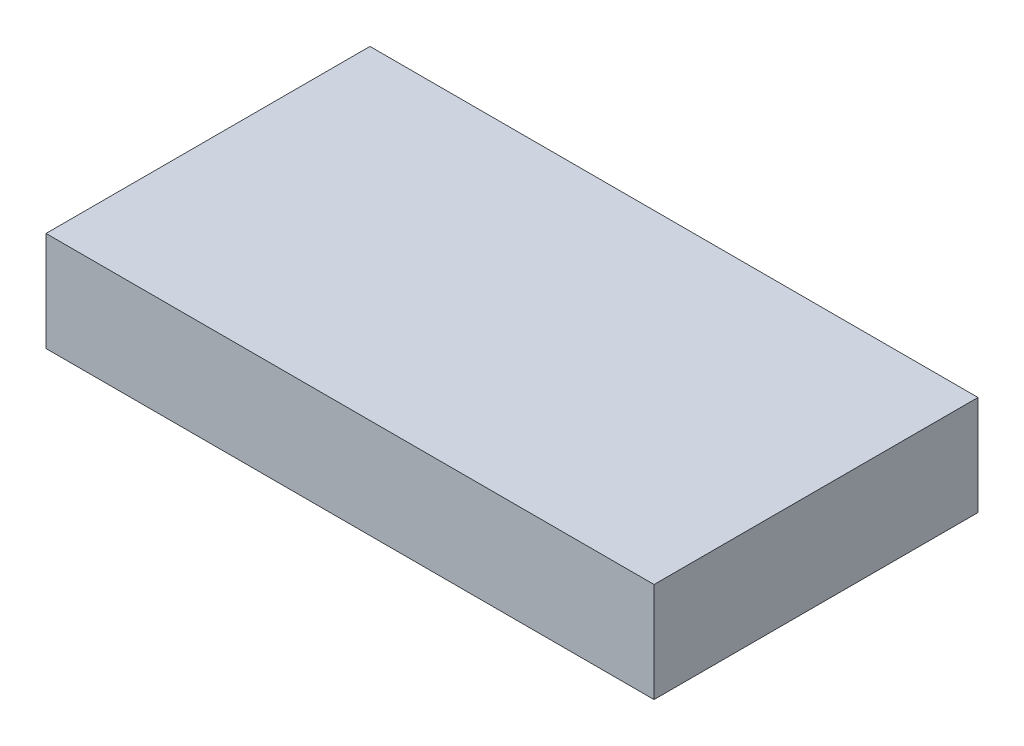
ISO-10303-21;
HEADER;
FILE_DESCRIPTION(('STEP AP214'),'2;1');
FILE_NAME('part.step','',(''),(''),'','','');
FILE_SCHEMA(('AUTOMOTIVE_DESIGN { 1 0 10303 214 1 1 1 1 }'));
ENDSEC;
DATA;
#1=APPLICATION_CONTEXT('core data for automotive mechanical design processes');
#2=APPLICATION_PROTOCOL_DEFINITION('international standard','automotive_design',2000,#1);
#3=PRODUCT_CONTEXT('',#1,'mechanical');
#4=PRODUCT('Part','Part','',(#3));
#5=PRODUCT_RELATED_PRODUCT_CATEGORY('part','',(#4));
#6=PRODUCT_DEFINITION_FORMATION('','',#4);
#7=PRODUCT_DEFINITION_CONTEXT('part definition',#1,'design');
#8=PRODUCT_DEFINITION('design','',#6,#7);
#9=PRODUCT_DEFINITION_SHAPE('','',#8);
#10=(LENGTH_UNIT() NAMED_UNIT(*) SI_UNIT(.MILLI.,.METRE.));
#11=(NAMED_UNIT(*) PLANE_ANGLE_UNIT() SI_UNIT($,.RADIAN.));
#12=(NAMED_UNIT(*) SI_UNIT($,.STERADIAN.) SOLID_ANGLE_UNIT());
#13=UNCERTAINTY_MEASURE_WITH_UNIT(LENGTH_MEASURE(1.E-05),#10,'distance_accuracy_value','');
#14=(GEOMETRIC_REPRESENTATION_CONTEXT(3) GLOBAL_UNCERTAINTY_ASSIGNED_CONTEXT((#13)) GLOBAL_UNIT_ASSIGNED_CONTEXT((#10,
#11,#12)) REPRESENTATION_CONTEXT('',''));
#15=CARTESIAN_POINT('',(0.,0.,0.));
#16=DIRECTION('',(0.,0.,1.));
#17=DIRECTION('',(1.,0.,0.));
#18=AXIS2_PLACEMENT_3D('',#15,#16,#17);
#19=CARTESIAN_POINT('',(0.,2.,0.5));
#20=DIRECTION('',(1.,0.,0.));
#21=DIRECTION('',(0.,0.,-1.));
#22=AXIS2_PLACEMENT_3D('',#19,#20,#21);
#23=PLANE('',#22);
#24=DIRECTION('',(0.,0.,1.));
#25=VECTOR('',#24,1.);
#26=CARTESIAN_POINT('',(0.,0.,0.5));
#27=LINE('',#26,#25);
#28=CARTESIAN_POINT('',(0.,0.,-6.));
#29=VERTEX_POINT('',#28);
#30=CARTESIAN_POINT('',(0.,0.,0.5));
#31=VERTEX_POINT('',#30);
#32=EDGE_CURVE('E96',#29,#31,#27,.T.);
#33=ORIENTED_EDGE('',*,*,#32,.T.);
#34=DIRECTION('',(0.,-1.,0.));
#35=VECTOR('',#34,1.);
#36=CARTESIAN_POINT('',(0.,2.,0.5));
#37=LINE('',#36,#35);
#38=CARTESIAN_POINT('',(0.,2.,0.5));
#39=VERTEX_POINT('',#38);
#40=EDGE_CURVE('E11',#39,#31,#37,.T.);
#41=ORIENTED_EDGE('',*,*,#40,.F.);
#42=DIRECTION('',(0.,0.,1.));
#43=VECTOR('',#42,1.);
#44=CARTESIAN_POINT('',(0.,2.,0.5));
#45=LINE('',#44,#43);
#46=CARTESIAN_POINT('',(0.,2.,-6.));
#47=VERTEX_POINT('',#46);
#48=EDGE_CURVE('E84',#47,#39,#45,.T.);
#49=ORIENTED_EDGE('',*,*,#48,.F.);
#50=DIRECTION('',(0.,-1.,0.));
#51=VECTOR('',#50,1.);
#52=CARTESIAN_POINT('',(0.,2.,-6.));
#53=LINE('',#52,#51);
#54=EDGE_CURVE('E92',#47,#29,#53,.T.);
#55=ORIENTED_EDGE('',*,*,#54,.T.);
#56=EDGE_LOOP('',(#33,#41,#49,#55));
#57=FACE_BOUND('',#56,.T.);
#58=ADVANCED_FACE('F33',(#57),#23,.F.);
#59=CARTESIAN_POINT('',(0.,2.,0.5));
#60=DIRECTION('',(0.,0.,-1.));
#61=DIRECTION('',(-1.,0.,0.));
#62=AXIS2_PLACEMENT_3D('',#59,#60,#61);
#63=PLANE('',#62);
#64=DIRECTION('',(1.,0.,0.));
#65=VECTOR('',#64,1.);
#66=CARTESIAN_POINT('',(0.,0.,0.5));
#67=LINE('',#66,#65);
#68=CARTESIAN_POINT('',(12.2,0.,0.5));
#69=VERTEX_POINT('',#68);
#70=EDGE_CURVE('E88',#31,#69,#67,.T.);
#71=ORIENTED_EDGE('',*,*,#70,.T.);
#72=DIRECTION('',(0.,-1.,0.));
#73=VECTOR('',#72,1.);
#74=CARTESIAN_POINT('',(12.2,2.,0.5));
#75=LINE('',#74,#73);
#76=CARTESIAN_POINT('',(12.2,2.,0.5));
#77=VERTEX_POINT('',#76);
#78=EDGE_CURVE('E41',#77,#69,#75,.T.);
#79=ORIENTED_EDGE('',*,*,#78,.F.);
#80=DIRECTION('',(1.,0.,0.));
#81=VECTOR('',#80,1.);
#82=CARTESIAN_POINT('',(0.,2.,0.5));
#83=LINE('',#82,#81);
#84=EDGE_CURVE('E79',#39,#77,#83,.T.);
#85=ORIENTED_EDGE('',*,*,#84,.F.);
#86=ORIENTED_EDGE('',*,*,#40,.T.);
#87=EDGE_LOOP('',(#71,#79,#85,#86));
#88=FACE_BOUND('',#87,.T.);
#89=ADVANCED_FACE('F87',(#88),#63,.F.);
#90=CARTESIAN_POINT('',(12.2,2.,0.5));
#91=DIRECTION('',(-1.,0.,0.));
#92=DIRECTION('',(0.,0.,1.));
#93=AXIS2_PLACEMENT_3D('',#90,#91,#92);
#94=PLANE('',#93);
#95=DIRECTION('',(0.,0.,-1.));
#96=VECTOR('',#95,1.);
#97=CARTESIAN_POINT('',(12.2,0.,0.5));
#98=LINE('',#97,#96);
#99=CARTESIAN_POINT('',(12.2,0.,-6.));
#100=VERTEX_POINT('',#99);
#101=EDGE_CURVE('E66',#69,#100,#98,.T.);
#102=ORIENTED_EDGE('',*,*,#101,.T.);
#103=DIRECTION('',(0.,-1.,0.));
#104=VECTOR('',#103,1.);
#105=CARTESIAN_POINT('',(12.2,2.,-6.));
#106=LINE('',#105,#104);
#107=CARTESIAN_POINT('',(12.2,2.,-6.));
#108=VERTEX_POINT('',#107);
#109=EDGE_CURVE('E89',#108,#100,#106,.T.);
#110=ORIENTED_EDGE('',*,*,#109,.F.);
#111=DIRECTION('',(0.,0.,-1.));
#112=VECTOR('',#111,1.);
#113=CARTESIAN_POINT('',(12.2,2.,0.5));
#114=LINE('',#113,#112);
#115=EDGE_CURVE('E82',#77,#108,#114,.T.);
#116=ORIENTED_EDGE('',*,*,#115,.F.);
#117=ORIENTED_EDGE('',*,*,#78,.T.);
#118=EDGE_LOOP('',(#102,#110,#116,#117));
#119=FACE_BOUND('',#118,.T.);
#120=ADVANCED_FACE('F90',(#119),#94,.F.);
#121=CARTESIAN_POINT('',(0.,2.,-6.));
#122=DIRECTION('',(0.,0.,1.));
#123=DIRECTION('',(1.,0.,0.));
#124=AXIS2_PLACEMENT_3D('',#121,#122,#123);
#125=PLANE('',#124);
#126=DIRECTION('',(-1.,0.,0.));
#127=VECTOR('',#126,1.);
#128=CARTESIAN_POINT('',(0.,0.,-6.));
#129=LINE('',#128,#127);
#130=EDGE_CURVE('E72',#100,#29,#129,.T.);
#131=ORIENTED_EDGE('',*,*,#130,.T.);
#132=ORIENTED_EDGE('',*,*,#54,.F.);
#133=DIRECTION('',(-1.,0.,0.));
#134=VECTOR('',#133,1.);
#135=CARTESIAN_POINT('',(0.,2.,-6.));
#136=LINE('',#135,#134);
#137=EDGE_CURVE('E49',#108,#47,#136,.T.);
#138=ORIENTED_EDGE('',*,*,#137,.F.);
#139=ORIENTED_EDGE('',*,*,#109,.T.);
#140=EDGE_LOOP('',(#131,#132,#138,#139));
#141=FACE_BOUND('',#140,.T.);
#142=ADVANCED_FACE('F103',(#141),#125,.F.);
#143=CARTESIAN_POINT('',(0.,2.,0.));
#144=DIRECTION('',(0.,-1.,0.));
#145=DIRECTION('',(0.,0.,-1.));
#146=AXIS2_PLACEMENT_3D('',#143,#144,#145);
#147=PLANE('',#146);
#148=ORIENTED_EDGE('',*,*,#48,.T.);
#149=ORIENTED_EDGE('',*,*,#84,.T.);
#150=ORIENTED_EDGE('',*,*,#115,.T.);
#151=ORIENTED_EDGE('',*,*,#137,.T.);
#152=EDGE_LOOP('',(#148,#149,#150,#151));
#153=FACE_BOUND('',#152,.T.);
#154=ADVANCED_FACE('F80',(#153),#147,.F.);
#155=CARTESIAN_POINT('',(0.,0.,0.));
#156=DIRECTION('',(0.,-1.,0.));
#157=DIRECTION('',(0.,0.,-1.));
#158=AXIS2_PLACEMENT_3D('',#155,#156,#157);
#159=PLANE('',#158);
#160=ORIENTED_EDGE('',*,*,#32,.F.);
#161=ORIENTED_EDGE('',*,*,#130,.F.);
#162=ORIENTED_EDGE('',*,*,#101,.F.);
#163=ORIENTED_EDGE('',*,*,#70,.F.);
#164=EDGE_LOOP('',(#160,#161,#162,#163));
#165=FACE_BOUND('',#164,.T.);
#166=ADVANCED_FACE('F106',(#165),#159,.T.);
#167=CLOSED_SHELL('',(#58,#89,#120,#142,#154,#166));
#168=MANIFOLD_SOLID_BREP('B2',#167);
#169=ADVANCED_BREP_SHAPE_REPRESENTATION('',(#18,#168),#14);
#170=SHAPE_DEFINITION_REPRESENTATION(#9,#169);
ENDSEC;
END-ISO-10303-21;
